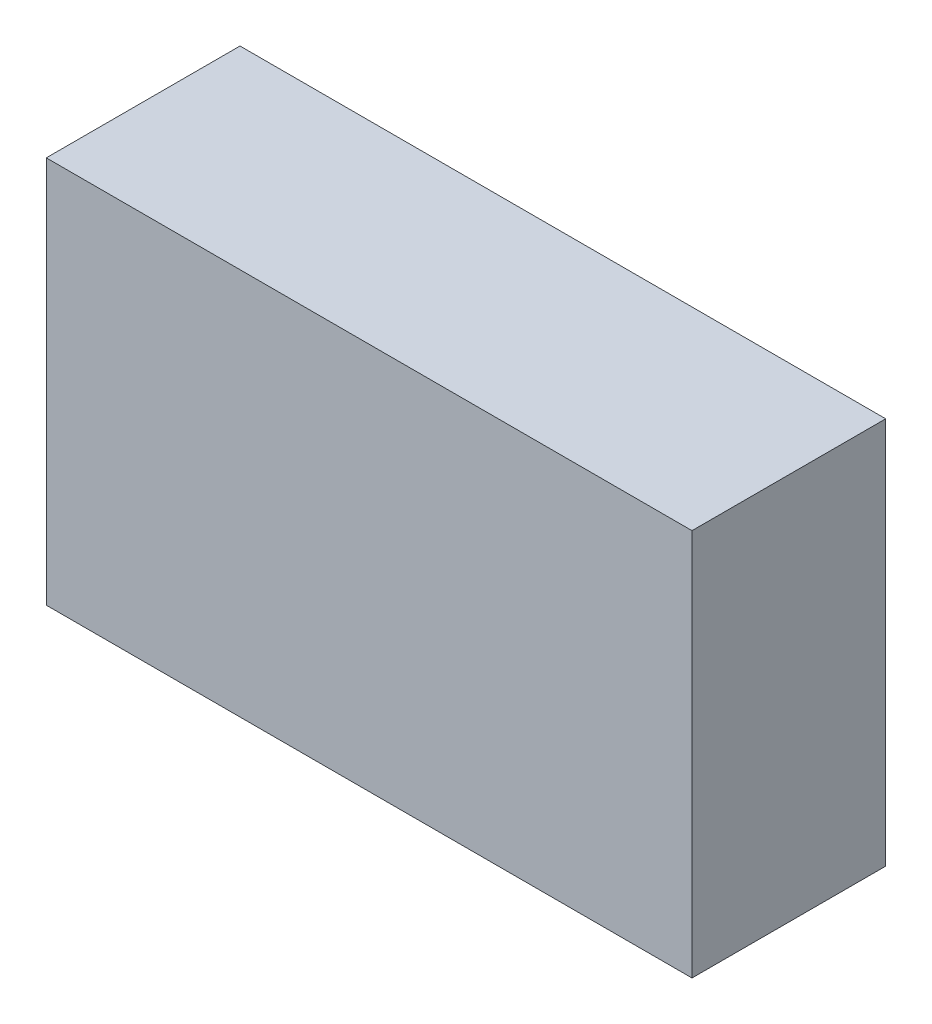
ISO-10303-21;
HEADER;
FILE_DESCRIPTION(('STEP AP214'),'2;1');
FILE_NAME('part.step','',(''),(''),'','','');
FILE_SCHEMA(('AUTOMOTIVE_DESIGN { 1 0 10303 214 1 1 1 1 }'));
ENDSEC;
DATA;
#1=APPLICATION_CONTEXT('core data for automotive mechanical design processes');
#2=APPLICATION_PROTOCOL_DEFINITION('international standard','automotive_design',2000,#1);
#3=PRODUCT_CONTEXT('',#1,'mechanical');
#4=PRODUCT('Part','Part','',(#3));
#5=PRODUCT_RELATED_PRODUCT_CATEGORY('part','',(#4));
#6=PRODUCT_DEFINITION_FORMATION('','',#4);
#7=PRODUCT_DEFINITION_CONTEXT('part definition',#1,'design');
#8=PRODUCT_DEFINITION('design','',#6,#7);
#9=PRODUCT_DEFINITION_SHAPE('','',#8);
#10=(LENGTH_UNIT() NAMED_UNIT(*) SI_UNIT(.MILLI.,.METRE.));
#11=(NAMED_UNIT(*) PLANE_ANGLE_UNIT() SI_UNIT($,.RADIAN.));
#12=(NAMED_UNIT(*) SI_UNIT($,.STERADIAN.) SOLID_ANGLE_UNIT());
#13=UNCERTAINTY_MEASURE_WITH_UNIT(LENGTH_MEASURE(1.E-05),#10,'distance_accuracy_value','');
#14=(GEOMETRIC_REPRESENTATION_CONTEXT(3) GLOBAL_UNCERTAINTY_ASSIGNED_CONTEXT((#13)) GLOBAL_UNIT_ASSIGNED_CONTEXT((#10,
#11,#12)) REPRESENTATION_CONTEXT('',''));
#15=CARTESIAN_POINT('',(0.,0.,0.));
#16=DIRECTION('',(0.,0.,1.));
#17=DIRECTION('',(1.,0.,0.));
#18=AXIS2_PLACEMENT_3D('',#15,#16,#17);
#19=CARTESIAN_POINT('',(10.,6.,6.));
#20=DIRECTION('',(-1.,0.,0.));
#21=DIRECTION('',(0.,-1.,0.));
#22=AXIS2_PLACEMENT_3D('',#19,#20,#21);
#23=PLANE('',#22);
#24=DIRECTION('',(0.,1.,0.));
#25=VECTOR('',#24,1.);
#26=CARTESIAN_POINT('',(10.,6.,0.));
#27=LINE('',#26,#25);
#28=CARTESIAN_POINT('',(10.,-6.,0.));
#29=VERTEX_POINT('',#28);
#30=CARTESIAN_POINT('',(10.,6.,0.));
#31=VERTEX_POINT('',#30);
#32=EDGE_CURVE('E107',#29,#31,#27,.T.);
#33=ORIENTED_EDGE('',*,*,#32,.T.);
#34=DIRECTION('',(0.,0.,-1.));
#35=VECTOR('',#34,1.);
#36=CARTESIAN_POINT('',(10.,6.,6.));
#37=LINE('',#36,#35);
#38=CARTESIAN_POINT('',(10.,6.,6.));
#39=VERTEX_POINT('',#38);
#40=EDGE_CURVE('E11',#39,#31,#37,.T.);
#41=ORIENTED_EDGE('',*,*,#40,.F.);
#42=DIRECTION('',(0.,1.,0.));
#43=VECTOR('',#42,1.);
#44=CARTESIAN_POINT('',(10.,6.,6.));
#45=LINE('',#44,#43);
#46=CARTESIAN_POINT('',(10.,-6.,6.));
#47=VERTEX_POINT('',#46);
#48=EDGE_CURVE('E91',#47,#39,#45,.T.);
#49=ORIENTED_EDGE('',*,*,#48,.F.);
#50=DIRECTION('',(0.,0.,-1.));
#51=VECTOR('',#50,1.);
#52=CARTESIAN_POINT('',(10.,-6.,6.));
#53=LINE('',#52,#51);
#54=EDGE_CURVE('E103',#47,#29,#53,.T.);
#55=ORIENTED_EDGE('',*,*,#54,.T.);
#56=EDGE_LOOP('',(#33,#41,#49,#55));
#57=FACE_BOUND('',#56,.T.);
#58=ADVANCED_FACE('F39',(#57),#23,.F.);
#59=CARTESIAN_POINT('',(-10.,6.,6.));
#60=DIRECTION('',(0.,-1.,0.));
#61=DIRECTION('',(0.,0.,-1.));
#62=AXIS2_PLACEMENT_3D('',#59,#60,#61);
#63=PLANE('',#62);
#64=DIRECTION('',(-1.,0.,0.));
#65=VECTOR('',#64,1.);
#66=CARTESIAN_POINT('',(-10.,6.,0.));
#67=LINE('',#66,#65);
#68=CARTESIAN_POINT('',(-10.,6.,0.));
#69=VERTEX_POINT('',#68);
#70=EDGE_CURVE('E96',#31,#69,#67,.T.);
#71=ORIENTED_EDGE('',*,*,#70,.T.);
#72=DIRECTION('',(0.,0.,-1.));
#73=VECTOR('',#72,1.);
#74=CARTESIAN_POINT('',(-10.,6.,6.));
#75=LINE('',#74,#73);
#76=CARTESIAN_POINT('',(-10.,6.,6.));
#77=VERTEX_POINT('',#76);
#78=EDGE_CURVE('E48',#77,#69,#75,.T.);
#79=ORIENTED_EDGE('',*,*,#78,.F.);
#80=DIRECTION('',(-1.,0.,0.));
#81=VECTOR('',#80,1.);
#82=CARTESIAN_POINT('',(-10.,6.,6.));
#83=LINE('',#82,#81);
#84=EDGE_CURVE('E86',#39,#77,#83,.T.);
#85=ORIENTED_EDGE('',*,*,#84,.F.);
#86=ORIENTED_EDGE('',*,*,#40,.T.);
#87=EDGE_LOOP('',(#71,#79,#85,#86));
#88=FACE_BOUND('',#87,.T.);
#89=ADVANCED_FACE('F95',(#88),#63,.F.);
#90=CARTESIAN_POINT('',(-10.,6.,6.));
#91=DIRECTION('',(1.,0.,0.));
#92=DIRECTION('',(0.,0.,-1.));
#93=AXIS2_PLACEMENT_3D('',#90,#91,#92);
#94=PLANE('',#93);
#95=DIRECTION('',(0.,-1.,0.));
#96=VECTOR('',#95,1.);
#97=CARTESIAN_POINT('',(-10.,6.,0.));
#98=LINE('',#97,#96);
#99=CARTESIAN_POINT('',(-10.,-6.,0.));
#100=VERTEX_POINT('',#99);
#101=EDGE_CURVE('E73',#69,#100,#98,.T.);
#102=ORIENTED_EDGE('',*,*,#101,.T.);
#103=DIRECTION('',(0.,0.,-1.));
#104=VECTOR('',#103,1.);
#105=CARTESIAN_POINT('',(-10.,-6.,6.));
#106=LINE('',#105,#104);
#107=CARTESIAN_POINT('',(-10.,-6.,6.));
#108=VERTEX_POINT('',#107);
#109=EDGE_CURVE('E98',#108,#100,#106,.T.);
#110=ORIENTED_EDGE('',*,*,#109,.F.);
#111=DIRECTION('',(0.,-1.,0.));
#112=VECTOR('',#111,1.);
#113=CARTESIAN_POINT('',(-10.,6.,6.));
#114=LINE('',#113,#112);
#115=EDGE_CURVE('E89',#77,#108,#114,.T.);
#116=ORIENTED_EDGE('',*,*,#115,.F.);
#117=ORIENTED_EDGE('',*,*,#78,.T.);
#118=EDGE_LOOP('',(#102,#110,#116,#117));
#119=FACE_BOUND('',#118,.T.);
#120=ADVANCED_FACE('F99',(#119),#94,.F.);
#121=CARTESIAN_POINT('',(-10.,-6.,6.));
#122=DIRECTION('',(0.,1.,0.));
#123=DIRECTION('',(0.,0.,1.));
#124=AXIS2_PLACEMENT_3D('',#121,#122,#123);
#125=PLANE('',#124);
#126=DIRECTION('',(1.,0.,0.));
#127=VECTOR('',#126,1.);
#128=CARTESIAN_POINT('',(-10.,-6.,0.));
#129=LINE('',#128,#127);
#130=EDGE_CURVE('E79',#100,#29,#129,.T.);
#131=ORIENTED_EDGE('',*,*,#130,.T.);
#132=ORIENTED_EDGE('',*,*,#54,.F.);
#133=DIRECTION('',(1.,0.,0.));
#134=VECTOR('',#133,1.);
#135=CARTESIAN_POINT('',(-10.,-6.,6.));
#136=LINE('',#135,#134);
#137=EDGE_CURVE('E56',#108,#47,#136,.T.);
#138=ORIENTED_EDGE('',*,*,#137,.F.);
#139=ORIENTED_EDGE('',*,*,#109,.T.);
#140=EDGE_LOOP('',(#131,#132,#138,#139));
#141=FACE_BOUND('',#140,.T.);
#142=ADVANCED_FACE('F120',(#141),#125,.F.);
#143=CARTESIAN_POINT('',(0.,0.,6.));
#144=DIRECTION('',(0.,0.,1.));
#145=DIRECTION('',(1.,0.,0.));
#146=AXIS2_PLACEMENT_3D('',#143,#144,#145);
#147=PLANE('',#146);
#148=ORIENTED_EDGE('',*,*,#48,.T.);
#149=ORIENTED_EDGE('',*,*,#84,.T.);
#150=ORIENTED_EDGE('',*,*,#115,.T.);
#151=ORIENTED_EDGE('',*,*,#137,.T.);
#152=EDGE_LOOP('',(#148,#149,#150,#151));
#153=FACE_BOUND('',#152,.T.);
#154=ADVANCED_FACE('F87',(#153),#147,.T.);
#155=CARTESIAN_POINT('',(0.,0.,0.));
#156=DIRECTION('',(0.,0.,1.));
#157=DIRECTION('',(1.,0.,0.));
#158=AXIS2_PLACEMENT_3D('',#155,#156,#157);
#159=PLANE('',#158);
#160=ORIENTED_EDGE('',*,*,#32,.F.);
#161=ORIENTED_EDGE('',*,*,#130,.F.);
#162=ORIENTED_EDGE('',*,*,#101,.F.);
#163=ORIENTED_EDGE('',*,*,#70,.F.);
#164=EDGE_LOOP('',(#160,#161,#162,#163));
#165=FACE_BOUND('',#164,.T.);
#166=ADVANCED_FACE('F123',(#165),#159,.F.);
#167=CLOSED_SHELL('',(#58,#89,#120,#142,#154,#166));
#168=MANIFOLD_SOLID_BREP('B2',#167);
#169=ADVANCED_BREP_SHAPE_REPRESENTATION('',(#18,#168),#14);
#170=SHAPE_DEFINITION_REPRESENTATION(#9,#169);
ENDSEC;
END-ISO-10303-21;
